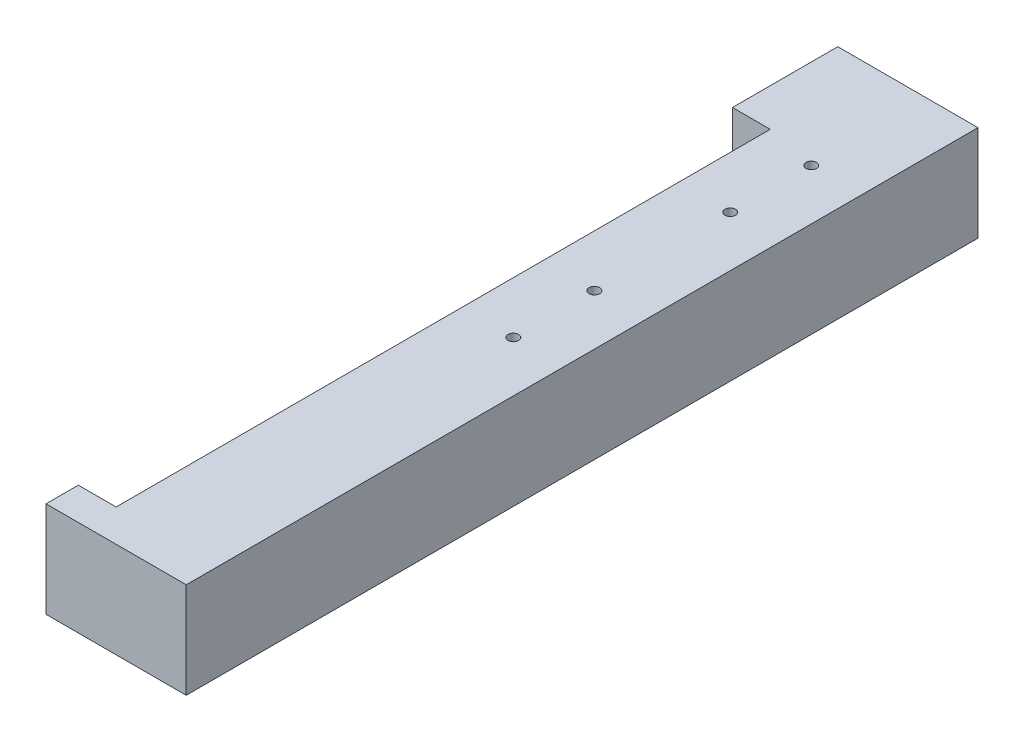
ISO-10303-21;
HEADER;
FILE_DESCRIPTION(('STEP AP214'),'2;1');
FILE_NAME('part.step','',(''),(''),'','','');
FILE_SCHEMA(('AUTOMOTIVE_DESIGN { 1 0 10303 214 1 1 1 1 }'));
ENDSEC;
DATA;
#1=APPLICATION_CONTEXT('core data for automotive mechanical design processes');
#2=APPLICATION_PROTOCOL_DEFINITION('international standard','automotive_design',2000,#1);
#3=PRODUCT_CONTEXT('',#1,'mechanical');
#4=PRODUCT('Part','Part','',(#3));
#5=PRODUCT_RELATED_PRODUCT_CATEGORY('part','',(#4));
#6=PRODUCT_DEFINITION_FORMATION('','',#4);
#7=PRODUCT_DEFINITION_CONTEXT('part definition',#1,'design');
#8=PRODUCT_DEFINITION('design','',#6,#7);
#9=PRODUCT_DEFINITION_SHAPE('','',#8);
#10=(LENGTH_UNIT() NAMED_UNIT(*) SI_UNIT(.MILLI.,.METRE.));
#11=(NAMED_UNIT(*) PLANE_ANGLE_UNIT() SI_UNIT($,.RADIAN.));
#12=(NAMED_UNIT(*) SI_UNIT($,.STERADIAN.) SOLID_ANGLE_UNIT());
#13=UNCERTAINTY_MEASURE_WITH_UNIT(LENGTH_MEASURE(1.E-05),#10,'distance_accuracy_value','');
#14=(GEOMETRIC_REPRESENTATION_CONTEXT(3) GLOBAL_UNCERTAINTY_ASSIGNED_CONTEXT((#13)) GLOBAL_UNIT_ASSIGNED_CONTEXT((#10,
#11,#12)) REPRESENTATION_CONTEXT('',''));
#15=CARTESIAN_POINT('',(0.,0.,0.));
#16=DIRECTION('',(0.,0.,1.));
#17=DIRECTION('',(1.,0.,0.));
#18=AXIS2_PLACEMENT_3D('',#15,#16,#17);
#19=CARTESIAN_POINT('',(0.,60.0000000000047,0.));
#20=DIRECTION('',(0.,0.,1.));
#21=DIRECTION('',(1.,0.,0.));
#22=AXIS2_PLACEMENT_3D('',#19,#20,#21);
#23=PLANE('',#22);
#24=DIRECTION('',(-1.,0.,0.));
#25=VECTOR('',#24,1.);
#26=CARTESIAN_POINT('',(0.,0.,0.));
#27=LINE('',#26,#25);
#28=CARTESIAN_POINT('',(0.,0.,0.));
#29=VERTEX_POINT('',#28);
#30=CARTESIAN_POINT('',(-87.9000000000028,0.,0.));
#31=VERTEX_POINT('',#30);
#32=EDGE_CURVE('E255',#29,#31,#27,.T.);
#33=ORIENTED_EDGE('',*,*,#32,.T.);
#34=DIRECTION('',(0.,-1.,0.));
#35=VECTOR('',#34,1.);
#36=CARTESIAN_POINT('',(-87.9000000000028,60.0000000000047,0.));
#37=LINE('',#36,#35);
#38=CARTESIAN_POINT('',(-87.9000000000028,60.0000000000047,0.));
#39=VERTEX_POINT('',#38);
#40=EDGE_CURVE('E159',#39,#31,#37,.T.);
#41=ORIENTED_EDGE('',*,*,#40,.F.);
#42=DIRECTION('',(-1.,0.,0.));
#43=VECTOR('',#42,1.);
#44=CARTESIAN_POINT('',(0.,60.0000000000047,0.));
#45=LINE('',#44,#43);
#46=CARTESIAN_POINT('',(0.,60.0000000000047,0.));
#47=VERTEX_POINT('',#46);
#48=EDGE_CURVE('E210',#47,#39,#45,.T.);
#49=ORIENTED_EDGE('',*,*,#48,.F.);
#50=DIRECTION('',(0.,-1.,0.));
#51=VECTOR('',#50,1.);
#52=CARTESIAN_POINT('',(0.,60.0000000000047,0.));
#53=LINE('',#52,#51);
#54=EDGE_CURVE('E12',#47,#29,#53,.T.);
#55=ORIENTED_EDGE('',*,*,#54,.T.);
#56=EDGE_LOOP('',(#33,#41,#49,#55));
#57=FACE_BOUND('',#56,.T.);
#58=ADVANCED_FACE('F149',(#57),#23,.F.);
#59=CARTESIAN_POINT('',(-87.9000000000028,60.0000000000047,0.));
#60=DIRECTION('',(1.,0.,0.));
#61=DIRECTION('',(0.,0.,-1.));
#62=AXIS2_PLACEMENT_3D('',#59,#60,#61);
#63=PLANE('',#62);
#64=CARTESIAN_POINT('',(-87.9000000000028,23.6750000001617,6.34999999995062));
#65=DIRECTION('',(1.,0.,0.));
#66=DIRECTION('',(0.,0.,-1.));
#67=AXIS2_PLACEMENT_3D('',#64,#65,#66);
#68=CIRCLE('',#67,1.58750000000001);
#69=CARTESIAN_POINT('',(-87.9000000000028,23.6750000001617,4.76249999995061));
#70=VERTEX_POINT('',#69);
#71=EDGE_CURVE('E374',#70,#70,#68,.T.);
#72=ORIENTED_EDGE('',*,*,#71,.T.);
#73=EDGE_LOOP('',(#72));
#74=FACE_BOUND('',#73,.T.);
#75=CARTESIAN_POINT('',(-87.9000000000028,23.6750000001617,31.7499999999507));
#76=DIRECTION('',(1.,0.,0.));
#77=DIRECTION('',(0.,0.,-1.));
#78=AXIS2_PLACEMENT_3D('',#75,#76,#77);
#79=CIRCLE('',#78,1.58750000000001);
#80=CARTESIAN_POINT('',(-87.9000000000028,23.6750000001617,30.1624999999506));
#81=VERTEX_POINT('',#80);
#82=EDGE_CURVE('E383',#81,#81,#79,.T.);
#83=ORIENTED_EDGE('',*,*,#82,.T.);
#84=EDGE_LOOP('',(#83));
#85=FACE_BOUND('',#84,.T.);
#86=CARTESIAN_POINT('',(-87.9000000000028,36.325000000146,31.7499999999558));
#87=DIRECTION('',(1.,0.,0.));
#88=DIRECTION('',(0.,0.,-1.));
#89=AXIS2_PLACEMENT_3D('',#86,#87,#88);
#90=CIRCLE('',#89,1.58749999999042);
#91=CARTESIAN_POINT('',(-87.9000000000028,36.325000000146,30.1624999999654));
#92=VERTEX_POINT('',#91);
#93=EDGE_CURVE('E391',#92,#92,#90,.T.);
#94=ORIENTED_EDGE('',*,*,#93,.T.);
#95=EDGE_LOOP('',(#94));
#96=FACE_BOUND('',#95,.T.);
#97=CARTESIAN_POINT('',(-87.9000000000028,53.0000000001478,46.9999999999514));
#98=DIRECTION('',(1.,0.,0.));
#99=DIRECTION('',(0.,0.,-1.));
#100=AXIS2_PLACEMENT_3D('',#97,#98,#99);
#101=CIRCLE('',#100,3.3);
#102=CARTESIAN_POINT('',(-87.9000000000028,53.0000000001478,43.6999999999514));
#103=VERTEX_POINT('',#102);
#104=EDGE_CURVE('E399',#103,#103,#101,.T.);
#105=ORIENTED_EDGE('',*,*,#104,.T.);
#106=EDGE_LOOP('',(#105));
#107=FACE_BOUND('',#106,.T.);
#108=CARTESIAN_POINT('',(-87.9000000000028,7.00000000014689,59.999999999952));
#109=DIRECTION('',(1.,0.,0.));
#110=DIRECTION('',(0.,0.,-1.));
#111=AXIS2_PLACEMENT_3D('',#108,#109,#110);
#112=CIRCLE('',#111,3.3);
#113=CARTESIAN_POINT('',(-87.9000000000028,7.00000000014689,56.699999999952));
#114=VERTEX_POINT('',#113);
#115=EDGE_CURVE('E350',#114,#114,#112,.T.);
#116=ORIENTED_EDGE('',*,*,#115,.T.);
#117=EDGE_LOOP('',(#116));
#118=FACE_BOUND('',#117,.T.);
#119=CARTESIAN_POINT('',(-87.9000000000028,7.00000000014769,46.9999999999512));
#120=DIRECTION('',(1.,0.,0.));
#121=DIRECTION('',(0.,0.,-1.));
#122=AXIS2_PLACEMENT_3D('',#119,#120,#121);
#123=CIRCLE('',#122,3.3);
#124=CARTESIAN_POINT('',(-87.9000000000028,7.00000000014769,43.6999999999512));
#125=VERTEX_POINT('',#124);
#126=EDGE_CURVE('E367',#125,#125,#123,.T.);
#127=ORIENTED_EDGE('',*,*,#126,.T.);
#128=EDGE_LOOP('',(#127));
#129=FACE_BOUND('',#128,.T.);
#130=CARTESIAN_POINT('',(-87.9000000000028,53.0000000001477,59.9999999999514));
#131=DIRECTION('',(1.,0.,0.));
#132=DIRECTION('',(0.,0.,-1.));
#133=AXIS2_PLACEMENT_3D('',#130,#131,#132);
#134=CIRCLE('',#133,3.3);
#135=CARTESIAN_POINT('',(-87.9000000000028,53.0000000001477,56.6999999999514));
#136=VERTEX_POINT('',#135);
#137=EDGE_CURVE('E358',#136,#136,#134,.T.);
#138=ORIENTED_EDGE('',*,*,#137,.T.);
#139=EDGE_LOOP('',(#138));
#140=FACE_BOUND('',#139,.T.);
#141=CARTESIAN_POINT('',(-87.9000000000028,36.3250000000795,6.34999999997421));
#142=DIRECTION('',(1.,0.,0.));
#143=DIRECTION('',(0.,0.,-1.));
#144=AXIS2_PLACEMENT_3D('',#141,#142,#143);
#145=CIRCLE('',#144,1.58749999995351);
#146=CARTESIAN_POINT('',(-87.9000000000028,36.3250000000795,4.7625000000207));
#147=VERTEX_POINT('',#146);
#148=EDGE_CURVE('E406',#147,#147,#145,.T.);
#149=ORIENTED_EDGE('',*,*,#148,.T.);
#150=EDGE_LOOP('',(#149));
#151=FACE_BOUND('',#150,.T.);
#152=DIRECTION('',(0.,0.,1.));
#153=VECTOR('',#152,1.);
#154=CARTESIAN_POINT('',(-87.9000000000028,0.,0.));
#155=LINE('',#154,#153);
#156=CARTESIAN_POINT('',(-87.9000000000028,0.,65.9999999999996));
#157=VERTEX_POINT('',#156);
#158=EDGE_CURVE('E259',#31,#157,#155,.T.);
#159=ORIENTED_EDGE('',*,*,#158,.T.);
#160=DIRECTION('',(0.,-1.,0.));
#161=VECTOR('',#160,1.);
#162=CARTESIAN_POINT('',(-87.9000000000028,60.0000000000047,65.9999999999996));
#163=LINE('',#162,#161);
#164=CARTESIAN_POINT('',(-87.9000000000028,60.0000000000047,65.9999999999996));
#165=VERTEX_POINT('',#164);
#166=EDGE_CURVE('E285',#165,#157,#163,.T.);
#167=ORIENTED_EDGE('',*,*,#166,.F.);
#168=DIRECTION('',(0.,0.,1.));
#169=VECTOR('',#168,1.);
#170=CARTESIAN_POINT('',(-87.9000000000028,60.0000000000047,0.));
#171=LINE('',#170,#169);
#172=EDGE_CURVE('E295',#39,#165,#171,.T.);
#173=ORIENTED_EDGE('',*,*,#172,.F.);
#174=ORIENTED_EDGE('',*,*,#40,.T.);
#175=EDGE_LOOP('',(#159,#167,#173,#174));
#176=FACE_BOUND('',#175,.T.);
#177=ADVANCED_FACE('F293',(#74,#85,#96,#107,#118,#129,#140,#151,#176),#63,.F.);
#178=CARTESIAN_POINT('',(-5.41058305374053E-13,60.0000000000047,66.0000000000003));
#179=DIRECTION('',(0.,0.,-1.));
#180=DIRECTION('',(-1.,0.,0.));
#181=AXIS2_PLACEMENT_3D('',#178,#179,#180);
#182=PLANE('',#181);
#183=DIRECTION('',(1.,0.,0.));
#184=VECTOR('',#183,1.);
#185=CARTESIAN_POINT('',(-5.41058305374053E-13,0.,66.0000000000003));
#186=LINE('',#185,#184);
#187=CARTESIAN_POINT('',(-64.2000109099997,0.,65.9999999999998));
#188=VERTEX_POINT('',#187);
#189=EDGE_CURVE('E262',#157,#188,#186,.T.);
#190=ORIENTED_EDGE('',*,*,#189,.T.);
#191=DIRECTION('',(0.,-1.,0.));
#192=VECTOR('',#191,1.);
#193=CARTESIAN_POINT('',(-64.2000109099997,60.0000000000047,65.9999999999998));
#194=LINE('',#193,#192);
#195=CARTESIAN_POINT('',(-64.2000109099997,60.0000000000047,65.9999999999998));
#196=VERTEX_POINT('',#195);
#197=EDGE_CURVE('E281',#196,#188,#194,.T.);
#198=ORIENTED_EDGE('',*,*,#197,.F.);
#199=DIRECTION('',(1.,0.,0.));
#200=VECTOR('',#199,1.);
#201=CARTESIAN_POINT('',(-5.41058305374053E-13,60.0000000000047,66.0000000000003));
#202=LINE('',#201,#200);
#203=EDGE_CURVE('E308',#165,#196,#202,.T.);
#204=ORIENTED_EDGE('',*,*,#203,.F.);
#205=ORIENTED_EDGE('',*,*,#166,.T.);
#206=EDGE_LOOP('',(#190,#198,#204,#205));
#207=FACE_BOUND('',#206,.T.);
#208=ADVANCED_FACE('F303',(#207),#182,.F.);
#209=CARTESIAN_POINT('',(-64.2000109099997,60.0000000000047,0.));
#210=DIRECTION('',(1.,0.,0.));
#211=DIRECTION('',(0.,0.,-1.));
#212=AXIS2_PLACEMENT_3D('',#209,#210,#211);
#213=PLANE('',#212);
#214=CARTESIAN_POINT('',(-64.2000109099996,30.0000000001482,258.499999999951));
#215=DIRECTION('',(1.,0.,0.));
#216=DIRECTION('',(0.,0.,-1.));
#217=AXIS2_PLACEMENT_3D('',#214,#215,#216);
#218=CIRCLE('',#217,1.75);
#219=CARTESIAN_POINT('',(-64.2000109099996,30.0000000001482,256.749999999951));
#220=VERTEX_POINT('',#219);
#221=EDGE_CURVE('E343',#220,#220,#218,.T.);
#222=ORIENTED_EDGE('',*,*,#221,.T.);
#223=EDGE_LOOP('',(#222));
#224=FACE_BOUND('',#223,.T.);
#225=CARTESIAN_POINT('',(-64.2000109099997,30.0000000001482,198.499999999951));
#226=DIRECTION('',(1.,0.,0.));
#227=DIRECTION('',(0.,0.,-1.));
#228=AXIS2_PLACEMENT_3D('',#225,#226,#227);
#229=CIRCLE('',#228,1.75);
#230=CARTESIAN_POINT('',(-64.2000109099997,30.0000000001482,196.749999999951));
#231=VERTEX_POINT('',#230);
#232=EDGE_CURVE('E335',#231,#231,#229,.T.);
#233=ORIENTED_EDGE('',*,*,#232,.T.);
#234=EDGE_LOOP('',(#233));
#235=FACE_BOUND('',#234,.T.);
#236=CARTESIAN_POINT('',(-64.2000109099997,30.0000000001482,138.499999999951));
#237=DIRECTION('',(1.,0.,0.));
#238=DIRECTION('',(0.,0.,-1.));
#239=AXIS2_PLACEMENT_3D('',#236,#237,#238);
#240=CIRCLE('',#239,1.75);
#241=CARTESIAN_POINT('',(-64.2000109099997,30.0000000001482,136.749999999951));
#242=VERTEX_POINT('',#241);
#243=EDGE_CURVE('E327',#242,#242,#240,.T.);
#244=ORIENTED_EDGE('',*,*,#243,.T.);
#245=EDGE_LOOP('',(#244));
#246=FACE_BOUND('',#245,.T.);
#247=CARTESIAN_POINT('',(-64.2000109099997,30.0000000001475,78.4999999999513));
#248=DIRECTION('',(1.,0.,0.));
#249=DIRECTION('',(0.,0.,-1.));
#250=AXIS2_PLACEMENT_3D('',#247,#248,#249);
#251=CIRCLE('',#250,1.75);
#252=CARTESIAN_POINT('',(-64.2000109099997,30.0000000001475,76.7499999999513));
#253=VERTEX_POINT('',#252);
#254=EDGE_CURVE('E318',#253,#253,#251,.T.);
#255=ORIENTED_EDGE('',*,*,#254,.T.);
#256=EDGE_LOOP('',(#255));
#257=FACE_BOUND('',#256,.T.);
#258=DIRECTION('',(0.,0.,1.));
#259=VECTOR('',#258,1.);
#260=CARTESIAN_POINT('',(-64.2000109099997,0.,0.));
#261=LINE('',#260,#259);
#262=CARTESIAN_POINT('',(-64.2000109099996,0.,475.99918));
#263=VERTEX_POINT('',#262);
#264=EDGE_CURVE('E265',#188,#263,#261,.T.);
#265=ORIENTED_EDGE('',*,*,#264,.T.);
#266=DIRECTION('',(0.,-1.,0.));
#267=VECTOR('',#266,1.);
#268=CARTESIAN_POINT('',(-64.2000109099996,60.0000000000047,475.99918));
#269=LINE('',#268,#267);
#270=CARTESIAN_POINT('',(-64.2000109099996,60.0000000000047,475.99918));
#271=VERTEX_POINT('',#270);
#272=EDGE_CURVE('E240',#271,#263,#269,.T.);
#273=ORIENTED_EDGE('',*,*,#272,.F.);
#274=DIRECTION('',(0.,0.,1.));
#275=VECTOR('',#274,1.);
#276=CARTESIAN_POINT('',(-64.2000109099997,60.0000000000047,0.));
#277=LINE('',#276,#275);
#278=EDGE_CURVE('E229',#196,#271,#277,.T.);
#279=ORIENTED_EDGE('',*,*,#278,.F.);
#280=ORIENTED_EDGE('',*,*,#197,.T.);
#281=EDGE_LOOP('',(#265,#273,#279,#280));
#282=FACE_BOUND('',#281,.T.);
#283=ADVANCED_FACE('F306',(#224,#235,#246,#257,#282),#213,.F.);
#284=CARTESIAN_POINT('',(0.,60.0000000000047,475.99918));
#285=DIRECTION('',(0.,0.,1.));
#286=DIRECTION('',(1.,0.,0.));
#287=AXIS2_PLACEMENT_3D('',#284,#285,#286);
#288=PLANE('',#287);
#289=DIRECTION('',(-1.,0.,0.));
#290=VECTOR('',#289,1.);
#291=CARTESIAN_POINT('',(0.,0.,475.99918));
#292=LINE('',#291,#290);
#293=CARTESIAN_POINT('',(-87.8999999999999,0.,475.99918));
#294=VERTEX_POINT('',#293);
#295=EDGE_CURVE('E238',#263,#294,#292,.T.);
#296=ORIENTED_EDGE('',*,*,#295,.T.);
#297=DIRECTION('',(0.,-1.,0.));
#298=VECTOR('',#297,1.);
#299=CARTESIAN_POINT('',(-87.8999999999999,60.0000000000047,475.99918));
#300=LINE('',#299,#298);
#301=CARTESIAN_POINT('',(-87.8999999999999,60.0000000000047,475.99918));
#302=VERTEX_POINT('',#301);
#303=EDGE_CURVE('E235',#302,#294,#300,.T.);
#304=ORIENTED_EDGE('',*,*,#303,.F.);
#305=DIRECTION('',(-1.,0.,0.));
#306=VECTOR('',#305,1.);
#307=CARTESIAN_POINT('',(0.,60.0000000000047,475.99918));
#308=LINE('',#307,#306);
#309=EDGE_CURVE('E223',#271,#302,#308,.T.);
#310=ORIENTED_EDGE('',*,*,#309,.F.);
#311=ORIENTED_EDGE('',*,*,#272,.T.);
#312=EDGE_LOOP('',(#296,#304,#310,#311));
#313=FACE_BOUND('',#312,.T.);
#314=ADVANCED_FACE('F236',(#313),#288,.F.);
#315=CARTESIAN_POINT('',(-87.9000000000005,60.0000000000047,1.20479757857473E-13));
#316=DIRECTION('',(1.,0.,0.));
#317=DIRECTION('',(0.,0.,-1.));
#318=AXIS2_PLACEMENT_3D('',#315,#316,#317);
#319=PLANE('',#318);
#320=DIRECTION('',(0.,0.,1.));
#321=VECTOR('',#320,1.);
#322=CARTESIAN_POINT('',(-87.9000000000005,0.,1.20479757857473E-13));
#323=LINE('',#322,#321);
#324=CARTESIAN_POINT('',(-87.8999999999998,0.,496.249179999999));
#325=VERTEX_POINT('',#324);
#326=EDGE_CURVE('E196',#294,#325,#323,.T.);
#327=ORIENTED_EDGE('',*,*,#326,.T.);
#328=DIRECTION('',(0.,-1.,0.));
#329=VECTOR('',#328,1.);
#330=CARTESIAN_POINT('',(-87.8999999999998,60.0000000000047,496.249179999999));
#331=LINE('',#330,#329);
#332=CARTESIAN_POINT('',(-87.8999999999998,60.0000000000047,496.249179999999));
#333=VERTEX_POINT('',#332);
#334=EDGE_CURVE('E241',#333,#325,#331,.T.);
#335=ORIENTED_EDGE('',*,*,#334,.F.);
#336=DIRECTION('',(0.,0.,1.));
#337=VECTOR('',#336,1.);
#338=CARTESIAN_POINT('',(-87.9000000000005,60.0000000000047,1.20479757857473E-13));
#339=LINE('',#338,#337);
#340=EDGE_CURVE('E227',#302,#333,#339,.T.);
#341=ORIENTED_EDGE('',*,*,#340,.F.);
#342=ORIENTED_EDGE('',*,*,#303,.T.);
#343=EDGE_LOOP('',(#327,#335,#341,#342));
#344=FACE_BOUND('',#343,.T.);
#345=ADVANCED_FACE('F243',(#344),#319,.F.);
#346=CARTESIAN_POINT('',(0.,60.0000000000047,496.249179999999));
#347=DIRECTION('',(0.,0.,-1.));
#348=DIRECTION('',(-1.,0.,0.));
#349=AXIS2_PLACEMENT_3D('',#346,#347,#348);
#350=PLANE('',#349);
#351=DIRECTION('',(1.,0.,0.));
#352=VECTOR('',#351,1.);
#353=CARTESIAN_POINT('',(0.,0.,496.249179999999));
#354=LINE('',#353,#352);
#355=CARTESIAN_POINT('',(0.,0.,496.249179999999));
#356=VERTEX_POINT('',#355);
#357=EDGE_CURVE('E202',#325,#356,#354,.T.);
#358=ORIENTED_EDGE('',*,*,#357,.T.);
#359=DIRECTION('',(0.,-1.,0.));
#360=VECTOR('',#359,1.);
#361=CARTESIAN_POINT('',(0.,60.0000000000047,496.249179999999));
#362=LINE('',#361,#360);
#363=CARTESIAN_POINT('',(0.,60.0000000000047,496.249179999999));
#364=VERTEX_POINT('',#363);
#365=EDGE_CURVE('E247',#364,#356,#362,.T.);
#366=ORIENTED_EDGE('',*,*,#365,.F.);
#367=DIRECTION('',(1.,0.,0.));
#368=VECTOR('',#367,1.);
#369=CARTESIAN_POINT('',(0.,60.0000000000047,496.249179999999));
#370=LINE('',#369,#368);
#371=EDGE_CURVE('E167',#333,#364,#370,.T.);
#372=ORIENTED_EDGE('',*,*,#371,.F.);
#373=ORIENTED_EDGE('',*,*,#334,.T.);
#374=EDGE_LOOP('',(#358,#366,#372,#373));
#375=FACE_BOUND('',#374,.T.);
#376=ADVANCED_FACE('F517',(#375),#350,.F.);
#377=CARTESIAN_POINT('',(0.,60.0000000000047,0.));
#378=DIRECTION('',(-1.,0.,0.));
#379=DIRECTION('',(0.,0.,1.));
#380=AXIS2_PLACEMENT_3D('',#377,#378,#379);
#381=PLANE('',#380);
#382=DIRECTION('',(0.,0.,-1.));
#383=VECTOR('',#382,1.);
#384=CARTESIAN_POINT('',(0.,0.,0.));
#385=LINE('',#384,#383);
#386=EDGE_CURVE('E251',#356,#29,#385,.T.);
#387=ORIENTED_EDGE('',*,*,#386,.T.);
#388=ORIENTED_EDGE('',*,*,#54,.F.);
#389=DIRECTION('',(0.,0.,-1.));
#390=VECTOR('',#389,1.);
#391=CARTESIAN_POINT('',(0.,60.0000000000047,0.));
#392=LINE('',#391,#390);
#393=EDGE_CURVE('E274',#364,#47,#392,.T.);
#394=ORIENTED_EDGE('',*,*,#393,.F.);
#395=ORIENTED_EDGE('',*,*,#365,.T.);
#396=EDGE_LOOP('',(#387,#388,#394,#395));
#397=FACE_BOUND('',#396,.T.);
#398=ADVANCED_FACE('F151',(#397),#381,.F.);
#399=CARTESIAN_POINT('',(0.,0.,0.));
#400=DIRECTION('',(0.,1.,0.));
#401=DIRECTION('',(0.,0.,1.));
#402=AXIS2_PLACEMENT_3D('',#399,#400,#401);
#403=PLANE('',#402);
#404=CARTESIAN_POINT('',(-31.7499999999997,0.,72.7499999999996));
#405=DIRECTION('',(0.,1.,0.));
#406=DIRECTION('',(0.,0.,1.));
#407=AXIS2_PLACEMENT_3D('',#404,#405,#406);
#408=CIRCLE('',#407,4.7625);
#409=CARTESIAN_POINT('',(-31.7499999999997,0.,77.5124999999996));
#410=VERTEX_POINT('',#409);
#411=EDGE_CURVE('E459',#410,#410,#408,.F.);
#412=ORIENTED_EDGE('',*,*,#411,.F.);
#413=EDGE_LOOP('',(#412));
#414=FACE_BOUND('',#413,.T.);
#415=CARTESIAN_POINT('',(-31.7499999999977,0.,259.5));
#416=DIRECTION('',(0.,1.,0.));
#417=DIRECTION('',(0.,0.,1.));
#418=AXIS2_PLACEMENT_3D('',#415,#416,#417);
#419=CIRCLE('',#418,4.7625);
#420=CARTESIAN_POINT('',(-31.7499999999977,0.,264.2625));
#421=VERTEX_POINT('',#420);
#422=EDGE_CURVE('E458',#421,#421,#419,.F.);
#423=ORIENTED_EDGE('',*,*,#422,.F.);
#424=EDGE_LOOP('',(#423));
#425=FACE_BOUND('',#424,.T.);
#426=CARTESIAN_POINT('',(-31.7499999999983,0.,208.7));
#427=DIRECTION('',(0.,1.,0.));
#428=DIRECTION('',(0.,0.,1.));
#429=AXIS2_PLACEMENT_3D('',#426,#427,#428);
#430=CIRCLE('',#429,4.7625);
#431=CARTESIAN_POINT('',(-31.7499999999983,0.,213.4625));
#432=VERTEX_POINT('',#431);
#433=EDGE_CURVE('E467',#432,#432,#430,.F.);
#434=ORIENTED_EDGE('',*,*,#433,.F.);
#435=EDGE_LOOP('',(#434));
#436=FACE_BOUND('',#435,.T.);
#437=CARTESIAN_POINT('',(-31.7499999999991,0.,123.55));
#438=DIRECTION('',(0.,1.,0.));
#439=DIRECTION('',(0.,0.,1.));
#440=AXIS2_PLACEMENT_3D('',#437,#438,#439);
#441=CIRCLE('',#440,4.7625);
#442=CARTESIAN_POINT('',(-31.7499999999991,0.,128.3125));
#443=VERTEX_POINT('',#442);
#444=EDGE_CURVE('E445',#443,#443,#441,.F.);
#445=ORIENTED_EDGE('',*,*,#444,.F.);
#446=EDGE_LOOP('',(#445));
#447=FACE_BOUND('',#446,.T.);
#448=ORIENTED_EDGE('',*,*,#386,.F.);
#449=ORIENTED_EDGE('',*,*,#357,.F.);
#450=ORIENTED_EDGE('',*,*,#326,.F.);
#451=ORIENTED_EDGE('',*,*,#295,.F.);
#452=ORIENTED_EDGE('',*,*,#264,.F.);
#453=ORIENTED_EDGE('',*,*,#189,.F.);
#454=ORIENTED_EDGE('',*,*,#158,.F.);
#455=ORIENTED_EDGE('',*,*,#32,.F.);
#456=EDGE_LOOP('',(#448,#449,#450,#451,#452,#453,#454,#455));
#457=FACE_BOUND('',#456,.T.);
#458=ADVANCED_FACE('F299',(#414,#425,#436,#447,#457),#403,.F.);
#459=CARTESIAN_POINT('',(0.,60.0000000000047,0.));
#460=DIRECTION('',(0.,1.,0.));
#461=DIRECTION('',(0.,0.,1.));
#462=AXIS2_PLACEMENT_3D('',#459,#460,#461);
#463=PLANE('',#462);
#464=CARTESIAN_POINT('',(-31.7499999999997,60.0000000000047,72.7499999999996));
#465=DIRECTION('',(0.,1.,0.));
#466=DIRECTION('',(0.,0.,1.));
#467=AXIS2_PLACEMENT_3D('',#464,#465,#466);
#468=CIRCLE('',#467,3.31248153285056);
#469=CARTESIAN_POINT('',(-31.7499999999997,60.0000000000047,76.0624815328502));
#470=VERTEX_POINT('',#469);
#471=EDGE_CURVE('E410',#470,#470,#468,.T.);
#472=ORIENTED_EDGE('',*,*,#471,.F.);
#473=EDGE_LOOP('',(#472));
#474=FACE_BOUND('',#473,.T.);
#475=CARTESIAN_POINT('',(-31.7499999999991,60.0000000000047,123.55));
#476=DIRECTION('',(0.,1.,0.));
#477=DIRECTION('',(0.,0.,1.));
#478=AXIS2_PLACEMENT_3D('',#475,#476,#477);
#479=CIRCLE('',#478,3.31248153285056);
#480=CARTESIAN_POINT('',(-31.7499999999991,60.0000000000047,126.86248153285));
#481=VERTEX_POINT('',#480);
#482=EDGE_CURVE('E431',#481,#481,#479,.T.);
#483=ORIENTED_EDGE('',*,*,#482,.F.);
#484=EDGE_LOOP('',(#483));
#485=FACE_BOUND('',#484,.T.);
#486=CARTESIAN_POINT('',(-31.7499999999983,60.0000000000047,208.7));
#487=DIRECTION('',(0.,1.,0.));
#488=DIRECTION('',(0.,0.,1.));
#489=AXIS2_PLACEMENT_3D('',#486,#487,#488);
#490=CIRCLE('',#489,3.31248153285054);
#491=CARTESIAN_POINT('',(-31.7499999999983,60.0000000000047,212.01248153285));
#492=VERTEX_POINT('',#491);
#493=EDGE_CURVE('E423',#492,#492,#490,.T.);
#494=ORIENTED_EDGE('',*,*,#493,.F.);
#495=EDGE_LOOP('',(#494));
#496=FACE_BOUND('',#495,.T.);
#497=CARTESIAN_POINT('',(-31.7499999999977,60.0000000000047,259.5));
#498=DIRECTION('',(0.,1.,0.));
#499=DIRECTION('',(0.,0.,1.));
#500=AXIS2_PLACEMENT_3D('',#497,#498,#499);
#501=CIRCLE('',#500,3.31248153285054);
#502=CARTESIAN_POINT('',(-31.7499999999977,60.0000000000047,262.81248153285));
#503=VERTEX_POINT('',#502);
#504=EDGE_CURVE('E418',#503,#503,#501,.T.);
#505=ORIENTED_EDGE('',*,*,#504,.F.);
#506=EDGE_LOOP('',(#505));
#507=FACE_BOUND('',#506,.T.);
#508=ORIENTED_EDGE('',*,*,#393,.T.);
#509=ORIENTED_EDGE('',*,*,#48,.T.);
#510=ORIENTED_EDGE('',*,*,#172,.T.);
#511=ORIENTED_EDGE('',*,*,#203,.T.);
#512=ORIENTED_EDGE('',*,*,#278,.T.);
#513=ORIENTED_EDGE('',*,*,#309,.T.);
#514=ORIENTED_EDGE('',*,*,#340,.T.);
#515=ORIENTED_EDGE('',*,*,#371,.T.);
#516=EDGE_LOOP('',(#508,#509,#510,#511,#512,#513,#514,#515));
#517=FACE_BOUND('',#516,.T.);
#518=ADVANCED_FACE('F225',(#474,#485,#496,#507,#517),#463,.T.);
#519=CARTESIAN_POINT('',(-57.8500109099997,30.0000000001475,78.4999999999513));
#520=DIRECTION('',(-1.,0.,0.));
#521=DIRECTION('',(0.,0.,1.));
#522=AXIS2_PLACEMENT_3D('',#519,#520,#521);
#523=CYLINDRICAL_SURFACE('',#522,1.75);
#524=CARTESIAN_POINT('',(-57.8500109099997,30.0000000001475,78.4999999999513));
#525=DIRECTION('',(1.,0.,0.));
#526=DIRECTION('',(0.,0.,-1.));
#527=AXIS2_PLACEMENT_3D('',#524,#525,#526);
#528=CIRCLE('',#527,1.75);
#529=CARTESIAN_POINT('',(-57.8500109099997,30.0000000001475,76.7499999999513));
#530=VERTEX_POINT('',#529);
#531=EDGE_CURVE('E322',#530,#530,#528,.T.);
#532=ORIENTED_EDGE('',*,*,#531,.T.);
#533=EDGE_LOOP('',(#532));
#534=FACE_BOUND('',#533,.T.);
#535=ORIENTED_EDGE('',*,*,#254,.F.);
#536=EDGE_LOOP('',(#535));
#537=FACE_BOUND('',#536,.T.);
#538=ADVANCED_FACE('F522',(#534,#537),#523,.F.);
#539=CARTESIAN_POINT('',(-57.8500109099997,30.0000000001475,78.4999999999513));
#540=DIRECTION('',(1.,0.,0.));
#541=DIRECTION('',(0.,0.,-1.));
#542=AXIS2_PLACEMENT_3D('',#539,#540,#541);
#543=PLANE('',#542);
#544=ORIENTED_EDGE('',*,*,#531,.F.);
#545=EDGE_LOOP('',(#544));
#546=FACE_BOUND('',#545,.T.);
#547=ADVANCED_FACE('F526',(#546),#543,.F.);
#548=CARTESIAN_POINT('',(-57.8500109099997,30.0000000001482,138.499999999951));
#549=DIRECTION('',(-1.,0.,0.));
#550=DIRECTION('',(0.,0.,1.));
#551=AXIS2_PLACEMENT_3D('',#548,#549,#550);
#552=CYLINDRICAL_SURFACE('',#551,1.75);
#553=CARTESIAN_POINT('',(-57.8500109099997,30.0000000001482,138.499999999951));
#554=DIRECTION('',(1.,0.,0.));
#555=DIRECTION('',(0.,0.,-1.));
#556=AXIS2_PLACEMENT_3D('',#553,#554,#555);
#557=CIRCLE('',#556,1.75);
#558=CARTESIAN_POINT('',(-57.8500109099997,30.0000000001482,136.749999999951));
#559=VERTEX_POINT('',#558);
#560=EDGE_CURVE('E331',#559,#559,#557,.T.);
#561=ORIENTED_EDGE('',*,*,#560,.T.);
#562=EDGE_LOOP('',(#561));
#563=FACE_BOUND('',#562,.T.);
#564=ORIENTED_EDGE('',*,*,#243,.F.);
#565=EDGE_LOOP('',(#564));
#566=FACE_BOUND('',#565,.T.);
#567=ADVANCED_FACE('F530',(#563,#566),#552,.F.);
#568=CARTESIAN_POINT('',(-57.8500109099997,30.0000000001482,138.499999999951));
#569=DIRECTION('',(1.,0.,0.));
#570=DIRECTION('',(0.,0.,-1.));
#571=AXIS2_PLACEMENT_3D('',#568,#569,#570);
#572=PLANE('',#571);
#573=ORIENTED_EDGE('',*,*,#560,.F.);
#574=EDGE_LOOP('',(#573));
#575=FACE_BOUND('',#574,.T.);
#576=ADVANCED_FACE('F534',(#575),#572,.F.);
#577=CARTESIAN_POINT('',(-57.8500109099997,30.0000000001482,198.499999999951));
#578=DIRECTION('',(-1.,0.,0.));
#579=DIRECTION('',(0.,0.,1.));
#580=AXIS2_PLACEMENT_3D('',#577,#578,#579);
#581=CYLINDRICAL_SURFACE('',#580,1.75);
#582=CARTESIAN_POINT('',(-57.8500109099997,30.0000000001482,198.499999999951));
#583=DIRECTION('',(1.,0.,0.));
#584=DIRECTION('',(0.,0.,-1.));
#585=AXIS2_PLACEMENT_3D('',#582,#583,#584);
#586=CIRCLE('',#585,1.75);
#587=CARTESIAN_POINT('',(-57.8500109099997,30.0000000001482,196.749999999951));
#588=VERTEX_POINT('',#587);
#589=EDGE_CURVE('E339',#588,#588,#586,.T.);
#590=ORIENTED_EDGE('',*,*,#589,.T.);
#591=EDGE_LOOP('',(#590));
#592=FACE_BOUND('',#591,.T.);
#593=ORIENTED_EDGE('',*,*,#232,.F.);
#594=EDGE_LOOP('',(#593));
#595=FACE_BOUND('',#594,.T.);
#596=ADVANCED_FACE('F538',(#592,#595),#581,.F.);
#597=CARTESIAN_POINT('',(-57.8500109099997,30.0000000001482,198.499999999951));
#598=DIRECTION('',(1.,0.,0.));
#599=DIRECTION('',(0.,0.,-1.));
#600=AXIS2_PLACEMENT_3D('',#597,#598,#599);
#601=PLANE('',#600);
#602=ORIENTED_EDGE('',*,*,#589,.F.);
#603=EDGE_LOOP('',(#602));
#604=FACE_BOUND('',#603,.T.);
#605=ADVANCED_FACE('F542',(#604),#601,.F.);
#606=CARTESIAN_POINT('',(-57.8500109099996,30.0000000001482,258.499999999951));
#607=DIRECTION('',(-1.,0.,0.));
#608=DIRECTION('',(0.,0.,1.));
#609=AXIS2_PLACEMENT_3D('',#606,#607,#608);
#610=CYLINDRICAL_SURFACE('',#609,1.75);
#611=CARTESIAN_POINT('',(-57.8500109099996,30.0000000001482,258.499999999951));
#612=DIRECTION('',(1.,0.,0.));
#613=DIRECTION('',(0.,0.,-1.));
#614=AXIS2_PLACEMENT_3D('',#611,#612,#613);
#615=CIRCLE('',#614,1.75);
#616=CARTESIAN_POINT('',(-57.8500109099996,30.0000000001482,256.749999999951));
#617=VERTEX_POINT('',#616);
#618=EDGE_CURVE('E256',#617,#617,#615,.T.);
#619=ORIENTED_EDGE('',*,*,#618,.T.);
#620=EDGE_LOOP('',(#619));
#621=FACE_BOUND('',#620,.T.);
#622=ORIENTED_EDGE('',*,*,#221,.F.);
#623=EDGE_LOOP('',(#622));
#624=FACE_BOUND('',#623,.T.);
#625=ADVANCED_FACE('F546',(#621,#624),#610,.F.);
#626=CARTESIAN_POINT('',(-57.8500109099996,30.0000000001482,258.499999999951));
#627=DIRECTION('',(1.,0.,0.));
#628=DIRECTION('',(0.,0.,-1.));
#629=AXIS2_PLACEMENT_3D('',#626,#627,#628);
#630=PLANE('',#629);
#631=ORIENTED_EDGE('',*,*,#618,.F.);
#632=EDGE_LOOP('',(#631));
#633=FACE_BOUND('',#632,.T.);
#634=ADVANCED_FACE('F550',(#633),#630,.F.);
#635=CARTESIAN_POINT('',(-81.5500000000028,36.3250000000795,6.34999999997421));
#636=DIRECTION('',(-1.,0.,0.));
#637=DIRECTION('',(0.,0.,1.));
#638=AXIS2_PLACEMENT_3D('',#635,#636,#637);
#639=CYLINDRICAL_SURFACE('',#638,1.58749999995351);
#640=CARTESIAN_POINT('',(-81.5500000000028,36.3250000000795,6.34999999997421));
#641=DIRECTION('',(1.,0.,0.));
#642=DIRECTION('',(0.,0.,-1.));
#643=AXIS2_PLACEMENT_3D('',#640,#641,#642);
#644=CIRCLE('',#643,1.58749999995351);
#645=CARTESIAN_POINT('',(-81.5500000000028,36.3250000000795,4.7625000000207));
#646=VERTEX_POINT('',#645);
#647=EDGE_CURVE('E379',#646,#646,#644,.T.);
#648=ORIENTED_EDGE('',*,*,#647,.T.);
#649=EDGE_LOOP('',(#648));
#650=FACE_BOUND('',#649,.T.);
#651=ORIENTED_EDGE('',*,*,#148,.F.);
#652=EDGE_LOOP('',(#651));
#653=FACE_BOUND('',#652,.T.);
#654=ADVANCED_FACE('F554',(#650,#653),#639,.F.);
#655=CARTESIAN_POINT('',(-81.5500000000028,36.3250000000795,6.34999999997421));
#656=DIRECTION('',(1.,0.,0.));
#657=DIRECTION('',(0.,0.,-1.));
#658=AXIS2_PLACEMENT_3D('',#655,#656,#657);
#659=PLANE('',#658);
#660=ORIENTED_EDGE('',*,*,#647,.F.);
#661=EDGE_LOOP('',(#660));
#662=FACE_BOUND('',#661,.T.);
#663=ADVANCED_FACE('F570',(#662),#659,.F.);
#664=CARTESIAN_POINT('',(-81.5500000000028,53.0000000001477,59.9999999999514));
#665=DIRECTION('',(-1.,0.,0.));
#666=DIRECTION('',(0.,0.,1.));
#667=AXIS2_PLACEMENT_3D('',#664,#665,#666);
#668=CYLINDRICAL_SURFACE('',#667,3.3);
#669=CARTESIAN_POINT('',(-81.5500000000028,53.0000000001477,59.9999999999514));
#670=DIRECTION('',(1.,0.,0.));
#671=DIRECTION('',(0.,0.,-1.));
#672=AXIS2_PLACEMENT_3D('',#669,#670,#671);
#673=CIRCLE('',#672,3.3);
#674=CARTESIAN_POINT('',(-81.5500000000028,53.0000000001477,56.6999999999514));
#675=VERTEX_POINT('',#674);
#676=EDGE_CURVE('E362',#675,#675,#673,.T.);
#677=ORIENTED_EDGE('',*,*,#676,.T.);
#678=EDGE_LOOP('',(#677));
#679=FACE_BOUND('',#678,.T.);
#680=ORIENTED_EDGE('',*,*,#137,.F.);
#681=EDGE_LOOP('',(#680));
#682=FACE_BOUND('',#681,.T.);
#683=ADVANCED_FACE('F566',(#679,#682),#668,.F.);
#684=CARTESIAN_POINT('',(-81.5500000000028,53.0000000001477,59.9999999999514));
#685=DIRECTION('',(1.,0.,0.));
#686=DIRECTION('',(0.,0.,-1.));
#687=AXIS2_PLACEMENT_3D('',#684,#685,#686);
#688=PLANE('',#687);
#689=ORIENTED_EDGE('',*,*,#676,.F.);
#690=EDGE_LOOP('',(#689));
#691=FACE_BOUND('',#690,.T.);
#692=ADVANCED_FACE('F569',(#691),#688,.F.);
#693=CARTESIAN_POINT('',(-81.5500000000028,7.00000000014769,46.9999999999512));
#694=DIRECTION('',(-1.,0.,0.));
#695=DIRECTION('',(0.,0.,1.));
#696=AXIS2_PLACEMENT_3D('',#693,#694,#695);
#697=CYLINDRICAL_SURFACE('',#696,3.3);
#698=CARTESIAN_POINT('',(-81.5500000000028,7.00000000014769,46.9999999999512));
#699=DIRECTION('',(1.,0.,0.));
#700=DIRECTION('',(0.,0.,-1.));
#701=AXIS2_PLACEMENT_3D('',#698,#699,#700);
#702=CIRCLE('',#701,3.3);
#703=CARTESIAN_POINT('',(-81.5500000000028,7.00000000014769,43.6999999999512));
#704=VERTEX_POINT('',#703);
#705=EDGE_CURVE('E354',#704,#704,#702,.T.);
#706=ORIENTED_EDGE('',*,*,#705,.T.);
#707=EDGE_LOOP('',(#706));
#708=FACE_BOUND('',#707,.T.);
#709=ORIENTED_EDGE('',*,*,#126,.F.);
#710=EDGE_LOOP('',(#709));
#711=FACE_BOUND('',#710,.T.);
#712=ADVANCED_FACE('F574',(#708,#711),#697,.F.);
#713=CARTESIAN_POINT('',(-81.5500000000028,7.00000000014769,46.9999999999512));
#714=DIRECTION('',(1.,0.,0.));
#715=DIRECTION('',(0.,0.,-1.));
#716=AXIS2_PLACEMENT_3D('',#713,#714,#715);
#717=PLANE('',#716);
#718=ORIENTED_EDGE('',*,*,#705,.F.);
#719=EDGE_LOOP('',(#718));
#720=FACE_BOUND('',#719,.T.);
#721=ADVANCED_FACE('F560',(#720),#717,.F.);
#722=CARTESIAN_POINT('',(-81.5500000000028,7.00000000014689,59.999999999952));
#723=DIRECTION('',(-1.,0.,0.));
#724=DIRECTION('',(0.,0.,1.));
#725=AXIS2_PLACEMENT_3D('',#722,#723,#724);
#726=CYLINDRICAL_SURFACE('',#725,3.3);
#727=CARTESIAN_POINT('',(-81.5500000000028,7.00000000014689,59.999999999952));
#728=DIRECTION('',(1.,0.,0.));
#729=DIRECTION('',(0.,0.,-1.));
#730=AXIS2_PLACEMENT_3D('',#727,#728,#729);
#731=CIRCLE('',#730,3.3);
#732=CARTESIAN_POINT('',(-81.5500000000028,7.00000000014689,56.699999999952));
#733=VERTEX_POINT('',#732);
#734=EDGE_CURVE('E323',#733,#733,#731,.T.);
#735=ORIENTED_EDGE('',*,*,#734,.T.);
#736=EDGE_LOOP('',(#735));
#737=FACE_BOUND('',#736,.T.);
#738=ORIENTED_EDGE('',*,*,#115,.F.);
#739=EDGE_LOOP('',(#738));
#740=FACE_BOUND('',#739,.T.);
#741=ADVANCED_FACE('F556',(#737,#740),#726,.F.);
#742=CARTESIAN_POINT('',(-81.5500000000028,7.00000000014689,59.999999999952));
#743=DIRECTION('',(1.,0.,0.));
#744=DIRECTION('',(0.,0.,-1.));
#745=AXIS2_PLACEMENT_3D('',#742,#743,#744);
#746=PLANE('',#745);
#747=ORIENTED_EDGE('',*,*,#734,.F.);
#748=EDGE_LOOP('',(#747));
#749=FACE_BOUND('',#748,.T.);
#750=ADVANCED_FACE('F559',(#749),#746,.F.);
#751=CARTESIAN_POINT('',(-81.5500000000028,53.0000000001478,46.9999999999514));
#752=DIRECTION('',(-1.,0.,0.));
#753=DIRECTION('',(0.,0.,1.));
#754=AXIS2_PLACEMENT_3D('',#751,#752,#753);
#755=CYLINDRICAL_SURFACE('',#754,3.3);
#756=CARTESIAN_POINT('',(-81.5500000000028,53.0000000001478,46.9999999999514));
#757=DIRECTION('',(1.,0.,0.));
#758=DIRECTION('',(0.,0.,-1.));
#759=AXIS2_PLACEMENT_3D('',#756,#757,#758);
#760=CIRCLE('',#759,3.3);
#761=CARTESIAN_POINT('',(-81.5500000000028,53.0000000001478,43.6999999999514));
#762=VERTEX_POINT('',#761);
#763=EDGE_CURVE('E363',#762,#762,#760,.T.);
#764=ORIENTED_EDGE('',*,*,#763,.T.);
#765=EDGE_LOOP('',(#764));
#766=FACE_BOUND('',#765,.T.);
#767=ORIENTED_EDGE('',*,*,#104,.F.);
#768=EDGE_LOOP('',(#767));
#769=FACE_BOUND('',#768,.T.);
#770=ADVANCED_FACE('F564',(#766,#769),#755,.F.);
#771=CARTESIAN_POINT('',(-81.5500000000028,53.0000000001478,46.9999999999514));
#772=DIRECTION('',(1.,0.,0.));
#773=DIRECTION('',(0.,0.,-1.));
#774=AXIS2_PLACEMENT_3D('',#771,#772,#773);
#775=PLANE('',#774);
#776=ORIENTED_EDGE('',*,*,#763,.F.);
#777=EDGE_LOOP('',(#776));
#778=FACE_BOUND('',#777,.T.);
#779=ADVANCED_FACE('F603',(#778),#775,.F.);
#780=CARTESIAN_POINT('',(-81.5500000000028,36.325000000146,31.7499999999558));
#781=DIRECTION('',(-1.,0.,0.));
#782=DIRECTION('',(0.,0.,1.));
#783=AXIS2_PLACEMENT_3D('',#780,#781,#782);
#784=CYLINDRICAL_SURFACE('',#783,1.58749999999042);
#785=CARTESIAN_POINT('',(-81.5500000000028,36.325000000146,31.7499999999558));
#786=DIRECTION('',(1.,0.,0.));
#787=DIRECTION('',(0.,0.,-1.));
#788=AXIS2_PLACEMENT_3D('',#785,#786,#787);
#789=CIRCLE('',#788,1.58749999999042);
#790=CARTESIAN_POINT('',(-81.5500000000028,36.325000000146,30.1624999999654));
#791=VERTEX_POINT('',#790);
#792=EDGE_CURVE('E395',#791,#791,#789,.T.);
#793=ORIENTED_EDGE('',*,*,#792,.T.);
#794=EDGE_LOOP('',(#793));
#795=FACE_BOUND('',#794,.T.);
#796=ORIENTED_EDGE('',*,*,#93,.F.);
#797=EDGE_LOOP('',(#796));
#798=FACE_BOUND('',#797,.T.);
#799=ADVANCED_FACE('F600',(#795,#798),#784,.F.);
#800=CARTESIAN_POINT('',(-81.5500000000028,36.325000000146,31.7499999999558));
#801=DIRECTION('',(1.,0.,0.));
#802=DIRECTION('',(0.,0.,-1.));
#803=AXIS2_PLACEMENT_3D('',#800,#801,#802);
#804=PLANE('',#803);
#805=ORIENTED_EDGE('',*,*,#792,.F.);
#806=EDGE_LOOP('',(#805));
#807=FACE_BOUND('',#806,.T.);
#808=ADVANCED_FACE('F595',(#807),#804,.F.);
#809=CARTESIAN_POINT('',(-81.5500000000028,23.6750000001617,31.7499999999507));
#810=DIRECTION('',(-1.,0.,0.));
#811=DIRECTION('',(0.,0.,1.));
#812=AXIS2_PLACEMENT_3D('',#809,#810,#811);
#813=CYLINDRICAL_SURFACE('',#812,1.58750000000001);
#814=CARTESIAN_POINT('',(-81.5500000000028,23.6750000001617,31.7499999999507));
#815=DIRECTION('',(1.,0.,0.));
#816=DIRECTION('',(0.,0.,-1.));
#817=AXIS2_PLACEMENT_3D('',#814,#815,#816);
#818=CIRCLE('',#817,1.58750000000001);
#819=CARTESIAN_POINT('',(-81.5500000000028,23.6750000001617,30.1624999999506));
#820=VERTEX_POINT('',#819);
#821=EDGE_CURVE('E387',#820,#820,#818,.T.);
#822=ORIENTED_EDGE('',*,*,#821,.T.);
#823=EDGE_LOOP('',(#822));
#824=FACE_BOUND('',#823,.T.);
#825=ORIENTED_EDGE('',*,*,#82,.F.);
#826=EDGE_LOOP('',(#825));
#827=FACE_BOUND('',#826,.T.);
#828=ADVANCED_FACE('F592',(#824,#827),#813,.F.);
#829=CARTESIAN_POINT('',(-81.5500000000028,23.6750000001617,31.7499999999507));
#830=DIRECTION('',(1.,0.,0.));
#831=DIRECTION('',(0.,0.,-1.));
#832=AXIS2_PLACEMENT_3D('',#829,#830,#831);
#833=PLANE('',#832);
#834=ORIENTED_EDGE('',*,*,#821,.F.);
#835=EDGE_LOOP('',(#834));
#836=FACE_BOUND('',#835,.T.);
#837=ADVANCED_FACE('F586',(#836),#833,.F.);
#838=CARTESIAN_POINT('',(-81.5500000000028,23.6750000001617,6.34999999995062));
#839=DIRECTION('',(-1.,0.,0.));
#840=DIRECTION('',(0.,0.,1.));
#841=AXIS2_PLACEMENT_3D('',#838,#839,#840);
#842=CYLINDRICAL_SURFACE('',#841,1.58750000000001);
#843=CARTESIAN_POINT('',(-81.5500000000028,23.6750000001617,6.34999999995062));
#844=DIRECTION('',(1.,0.,0.));
#845=DIRECTION('',(0.,0.,-1.));
#846=AXIS2_PLACEMENT_3D('',#843,#844,#845);
#847=CIRCLE('',#846,1.58750000000001);
#848=CARTESIAN_POINT('',(-81.5500000000028,23.6750000001617,4.76249999995061));
#849=VERTEX_POINT('',#848);
#850=EDGE_CURVE('E378',#849,#849,#847,.T.);
#851=ORIENTED_EDGE('',*,*,#850,.T.);
#852=EDGE_LOOP('',(#851));
#853=FACE_BOUND('',#852,.T.);
#854=ORIENTED_EDGE('',*,*,#71,.F.);
#855=EDGE_LOOP('',(#854));
#856=FACE_BOUND('',#855,.T.);
#857=ADVANCED_FACE('F582',(#853,#856),#842,.F.);
#858=CARTESIAN_POINT('',(-81.5500000000028,23.6750000001617,6.34999999995062));
#859=DIRECTION('',(1.,0.,0.));
#860=DIRECTION('',(0.,0.,-1.));
#861=AXIS2_PLACEMENT_3D('',#858,#859,#860);
#862=PLANE('',#861);
#863=ORIENTED_EDGE('',*,*,#850,.F.);
#864=EDGE_LOOP('',(#863));
#865=FACE_BOUND('',#864,.T.);
#866=ADVANCED_FACE('F585',(#865),#862,.F.);
#867=CARTESIAN_POINT('',(-31.7499999999977,47.3000000000047,259.5));
#868=DIRECTION('',(0.,1.,0.));
#869=DIRECTION('',(0.,0.,1.));
#870=AXIS2_PLACEMENT_3D('',#867,#868,#869);
#871=CYLINDRICAL_SURFACE('',#870,3.31248153285054);
#872=CARTESIAN_POINT('',(-31.7499999999977,47.3000000000047,259.5));
#873=DIRECTION('',(0.,1.,0.));
#874=DIRECTION('',(0.,0.,1.));
#875=AXIS2_PLACEMENT_3D('',#872,#873,#874);
#876=CIRCLE('',#875,3.31248153285054);
#877=CARTESIAN_POINT('',(-31.7499999999977,47.3000000000047,262.81248153285));
#878=VERTEX_POINT('',#877);
#879=EDGE_CURVE('E414',#878,#878,#876,.T.);
#880=ORIENTED_EDGE('',*,*,#879,.F.);
#881=EDGE_LOOP('',(#880));
#882=FACE_BOUND('',#881,.T.);
#883=ORIENTED_EDGE('',*,*,#504,.T.);
#884=EDGE_LOOP('',(#883));
#885=FACE_BOUND('',#884,.T.);
#886=ADVANCED_FACE('F590',(#882,#885),#871,.F.);
#887=CARTESIAN_POINT('',(-31.7499999999983,47.3000000000047,208.7));
#888=DIRECTION('',(0.,1.,0.));
#889=DIRECTION('',(0.,0.,1.));
#890=AXIS2_PLACEMENT_3D('',#887,#888,#889);
#891=CYLINDRICAL_SURFACE('',#890,3.31248153285054);
#892=CARTESIAN_POINT('',(-31.7499999999983,47.3000000000047,208.7));
#893=DIRECTION('',(0.,1.,0.));
#894=DIRECTION('',(0.,0.,1.));
#895=AXIS2_PLACEMENT_3D('',#892,#893,#894);
#896=CIRCLE('',#895,3.31248153285054);
#897=CARTESIAN_POINT('',(-31.7499999999983,47.3000000000047,212.01248153285));
#898=VERTEX_POINT('',#897);
#899=EDGE_CURVE('E419',#898,#898,#896,.T.);
#900=ORIENTED_EDGE('',*,*,#899,.F.);
#901=EDGE_LOOP('',(#900));
#902=FACE_BOUND('',#901,.T.);
#903=ORIENTED_EDGE('',*,*,#493,.T.);
#904=EDGE_LOOP('',(#903));
#905=FACE_BOUND('',#904,.T.);
#906=ADVANCED_FACE('F622',(#902,#905),#891,.F.);
#907=CARTESIAN_POINT('',(-31.7499999999991,47.3000000000047,123.55));
#908=DIRECTION('',(0.,1.,0.));
#909=DIRECTION('',(0.,0.,1.));
#910=AXIS2_PLACEMENT_3D('',#907,#908,#909);
#911=CYLINDRICAL_SURFACE('',#910,3.31248153285056);
#912=CARTESIAN_POINT('',(-31.7499999999991,47.3000000000047,123.55));
#913=DIRECTION('',(0.,1.,0.));
#914=DIRECTION('',(0.,0.,1.));
#915=AXIS2_PLACEMENT_3D('',#912,#913,#914);
#916=CIRCLE('',#915,3.31248153285056);
#917=CARTESIAN_POINT('',(-31.7499999999991,47.3000000000047,126.86248153285));
#918=VERTEX_POINT('',#917);
#919=EDGE_CURVE('E427',#918,#918,#916,.T.);
#920=ORIENTED_EDGE('',*,*,#919,.F.);
#921=EDGE_LOOP('',(#920));
#922=FACE_BOUND('',#921,.T.);
#923=ORIENTED_EDGE('',*,*,#482,.T.);
#924=EDGE_LOOP('',(#923));
#925=FACE_BOUND('',#924,.T.);
#926=ADVANCED_FACE('F498',(#922,#925),#911,.F.);
#927=CARTESIAN_POINT('',(-31.7499999999997,47.3000000000047,72.7499999999996));
#928=DIRECTION('',(0.,1.,0.));
#929=DIRECTION('',(0.,0.,1.));
#930=AXIS2_PLACEMENT_3D('',#927,#928,#929);
#931=CYLINDRICAL_SURFACE('',#930,3.31248153285056);
#932=CARTESIAN_POINT('',(-31.7499999999997,47.3000000000047,72.7499999999996));
#933=DIRECTION('',(0.,1.,0.));
#934=DIRECTION('',(0.,0.,1.));
#935=AXIS2_PLACEMENT_3D('',#932,#933,#934);
#936=CIRCLE('',#935,3.31248153285056);
#937=CARTESIAN_POINT('',(-31.7499999999997,47.3000000000047,76.0624815328502));
#938=VERTEX_POINT('',#937);
#939=EDGE_CURVE('E435',#938,#938,#936,.T.);
#940=ORIENTED_EDGE('',*,*,#939,.F.);
#941=EDGE_LOOP('',(#940));
#942=FACE_BOUND('',#941,.T.);
#943=ORIENTED_EDGE('',*,*,#471,.T.);
#944=EDGE_LOOP('',(#943));
#945=FACE_BOUND('',#944,.T.);
#946=ADVANCED_FACE('F489',(#942,#945),#931,.F.);
#947=CARTESIAN_POINT('',(-31.7499999999991,-0.001000000000001,123.55));
#948=DIRECTION('',(0.,1.,0.));
#949=DIRECTION('',(0.,0.,1.));
#950=AXIS2_PLACEMENT_3D('',#947,#948,#949);
#951=CYLINDRICAL_SURFACE('',#950,4.7625);
#952=CARTESIAN_POINT('',(-31.7499999999991,47.3000000000047,123.55));
#953=DIRECTION('',(0.,1.,0.));
#954=DIRECTION('',(0.,0.,1.));
#955=AXIS2_PLACEMENT_3D('',#952,#953,#954);
#956=CIRCLE('',#955,4.7625);
#957=CARTESIAN_POINT('',(-31.7499999999991,47.3000000000047,128.3125));
#958=VERTEX_POINT('',#957);
#959=EDGE_CURVE('E449',#958,#958,#956,.T.);
#960=ORIENTED_EDGE('',*,*,#959,.T.);
#961=EDGE_LOOP('',(#960));
#962=FACE_BOUND('',#961,.T.);
#963=ORIENTED_EDGE('',*,*,#444,.T.);
#964=EDGE_LOOP('',(#963));
#965=FACE_BOUND('',#964,.T.);
#966=ADVANCED_FACE('F486',(#962,#965),#951,.F.);
#967=CARTESIAN_POINT('',(-31.7499999999991,47.3000000000047,123.55));
#968=DIRECTION('',(0.,1.,0.));
#969=DIRECTION('',(0.,0.,1.));
#970=AXIS2_PLACEMENT_3D('',#967,#968,#969);
#971=PLANE('',#970);
#972=ORIENTED_EDGE('',*,*,#919,.T.);
#973=EDGE_LOOP('',(#972));
#974=FACE_BOUND('',#973,.T.);
#975=ORIENTED_EDGE('',*,*,#959,.F.);
#976=EDGE_LOOP('',(#975));
#977=FACE_BOUND('',#976,.T.);
#978=ADVANCED_FACE('F488',(#974,#977),#971,.F.);
#979=CARTESIAN_POINT('',(-31.7499999999983,-0.001000000000001,208.7));
#980=DIRECTION('',(0.,1.,0.));
#981=DIRECTION('',(0.,0.,1.));
#982=AXIS2_PLACEMENT_3D('',#979,#980,#981);
#983=CYLINDRICAL_SURFACE('',#982,4.7625);
#984=CARTESIAN_POINT('',(-31.7499999999983,47.3000000000047,208.7));
#985=DIRECTION('',(0.,1.,0.));
#986=DIRECTION('',(0.,0.,1.));
#987=AXIS2_PLACEMENT_3D('',#984,#985,#986);
#988=CIRCLE('',#987,4.7625);
#989=CARTESIAN_POINT('',(-31.7499999999983,47.3000000000047,213.4625));
#990=VERTEX_POINT('',#989);
#991=EDGE_CURVE('E453',#990,#990,#988,.T.);
#992=ORIENTED_EDGE('',*,*,#991,.T.);
#993=EDGE_LOOP('',(#992));
#994=FACE_BOUND('',#993,.T.);
#995=ORIENTED_EDGE('',*,*,#433,.T.);
#996=EDGE_LOOP('',(#995));
#997=FACE_BOUND('',#996,.T.);
#998=ADVANCED_FACE('F478',(#994,#997),#983,.F.);
#999=CARTESIAN_POINT('',(-31.7499999999983,47.3000000000047,208.7));
#1000=DIRECTION('',(0.,1.,0.));
#1001=DIRECTION('',(0.,0.,1.));
#1002=AXIS2_PLACEMENT_3D('',#999,#1000,#1001);
#1003=PLANE('',#1002);
#1004=ORIENTED_EDGE('',*,*,#899,.T.);
#1005=EDGE_LOOP('',(#1004));
#1006=FACE_BOUND('',#1005,.T.);
#1007=ORIENTED_EDGE('',*,*,#991,.F.);
#1008=EDGE_LOOP('',(#1007));
#1009=FACE_BOUND('',#1008,.T.);
#1010=ADVANCED_FACE('F677',(#1006,#1009),#1003,.F.);
#1011=CARTESIAN_POINT('',(-31.7499999999977,-0.001000000000001,259.5));
#1012=DIRECTION('',(0.,1.,0.));
#1013=DIRECTION('',(0.,0.,1.));
#1014=AXIS2_PLACEMENT_3D('',#1011,#1012,#1013);
#1015=CYLINDRICAL_SURFACE('',#1014,4.7625);
#1016=CARTESIAN_POINT('',(-31.7499999999977,47.3000000000047,259.5));
#1017=DIRECTION('',(0.,1.,0.));
#1018=DIRECTION('',(0.,0.,1.));
#1019=AXIS2_PLACEMENT_3D('',#1016,#1017,#1018);
#1020=CIRCLE('',#1019,4.7625);
#1021=CARTESIAN_POINT('',(-31.7499999999977,47.3000000000047,264.2625));
#1022=VERTEX_POINT('',#1021);
#1023=EDGE_CURVE('E463',#1022,#1022,#1020,.T.);
#1024=ORIENTED_EDGE('',*,*,#1023,.T.);
#1025=EDGE_LOOP('',(#1024));
#1026=FACE_BOUND('',#1025,.T.);
#1027=ORIENTED_EDGE('',*,*,#422,.T.);
#1028=EDGE_LOOP('',(#1027));
#1029=FACE_BOUND('',#1028,.T.);
#1030=ADVANCED_FACE('F687',(#1026,#1029),#1015,.F.);
#1031=CARTESIAN_POINT('',(-31.7499999999977,47.3000000000047,259.5));
#1032=DIRECTION('',(0.,1.,0.));
#1033=DIRECTION('',(0.,0.,1.));
#1034=AXIS2_PLACEMENT_3D('',#1031,#1032,#1033);
#1035=PLANE('',#1034);
#1036=ORIENTED_EDGE('',*,*,#879,.T.);
#1037=EDGE_LOOP('',(#1036));
#1038=FACE_BOUND('',#1037,.T.);
#1039=ORIENTED_EDGE('',*,*,#1023,.F.);
#1040=EDGE_LOOP('',(#1039));
#1041=FACE_BOUND('',#1040,.T.);
#1042=ADVANCED_FACE('F697',(#1038,#1041),#1035,.F.);
#1043=CARTESIAN_POINT('',(-31.7499999999997,-0.001000000000001,72.7499999999996));
#1044=DIRECTION('',(0.,1.,0.));
#1045=DIRECTION('',(0.,0.,1.));
#1046=AXIS2_PLACEMENT_3D('',#1043,#1044,#1045);
#1047=CYLINDRICAL_SURFACE('',#1046,4.7625);
#1048=CARTESIAN_POINT('',(-31.7499999999997,47.3000000000047,72.7499999999996));
#1049=DIRECTION('',(0.,1.,0.));
#1050=DIRECTION('',(0.,0.,1.));
#1051=AXIS2_PLACEMENT_3D('',#1048,#1049,#1050);
#1052=CIRCLE('',#1051,4.7625);
#1053=CARTESIAN_POINT('',(-31.7499999999997,47.3000000000047,77.5124999999996));
#1054=VERTEX_POINT('',#1053);
#1055=EDGE_CURVE('E454',#1054,#1054,#1052,.T.);
#1056=ORIENTED_EDGE('',*,*,#1055,.T.);
#1057=EDGE_LOOP('',(#1056));
#1058=FACE_BOUND('',#1057,.T.);
#1059=ORIENTED_EDGE('',*,*,#411,.T.);
#1060=EDGE_LOOP('',(#1059));
#1061=FACE_BOUND('',#1060,.T.);
#1062=ADVANCED_FACE('F707',(#1058,#1061),#1047,.F.);
#1063=CARTESIAN_POINT('',(-31.7499999999997,47.3000000000047,72.7499999999996));
#1064=DIRECTION('',(0.,1.,0.));
#1065=DIRECTION('',(0.,0.,1.));
#1066=AXIS2_PLACEMENT_3D('',#1063,#1064,#1065);
#1067=PLANE('',#1066);
#1068=ORIENTED_EDGE('',*,*,#939,.T.);
#1069=EDGE_LOOP('',(#1068));
#1070=FACE_BOUND('',#1069,.T.);
#1071=ORIENTED_EDGE('',*,*,#1055,.F.);
#1072=EDGE_LOOP('',(#1071));
#1073=FACE_BOUND('',#1072,.T.);
#1074=ADVANCED_FACE('F717',(#1070,#1073),#1067,.F.);
#1075=CLOSED_SHELL('',(#58,#177,#208,#283,#314,#345,#376,#398,#458,#518,#538,#547,#567,#576,
#596,#605,#625,#634,#654,#663,#683,#692,#712,#721,#741,#750,#770,#779,#799,#808,#828,#837,#857,
#866,#886,#906,#926,#946,#966,#978,#998,#1010,#1030,#1042,#1062,#1074));
#1076=MANIFOLD_SOLID_BREP('B2',#1075);
#1077=ADVANCED_BREP_SHAPE_REPRESENTATION('',(#18,#1076),#14);
#1078=SHAPE_DEFINITION_REPRESENTATION(#9,#1077);
ENDSEC;
END-ISO-10303-21;
